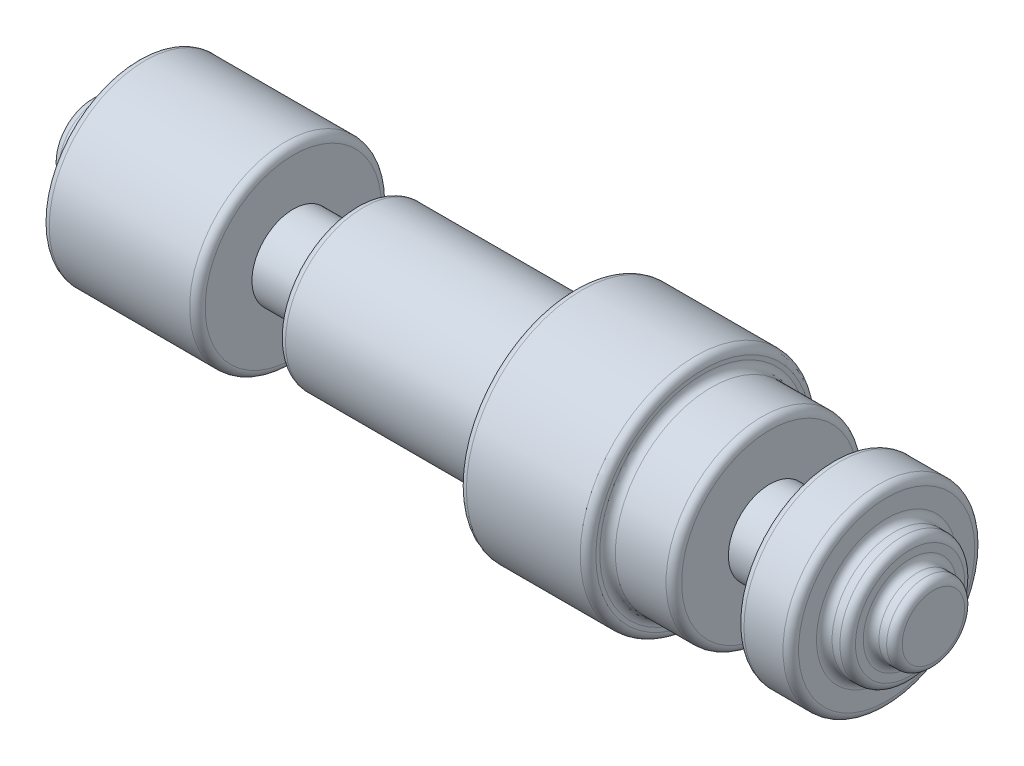
ISO-10303-21;
HEADER;
FILE_DESCRIPTION(('STEP AP214'),'2;1');
FILE_NAME('part.step','',(''),(''),'','','');
FILE_SCHEMA(('AUTOMOTIVE_DESIGN { 1 0 10303 214 1 1 1 1 }'));
ENDSEC;
DATA;
#1=APPLICATION_CONTEXT('core data for automotive mechanical design processes');
#2=APPLICATION_PROTOCOL_DEFINITION('international standard','automotive_design',2000,#1);
#3=PRODUCT_CONTEXT('',#1,'mechanical');
#4=PRODUCT('Part','Part','',(#3));
#5=PRODUCT_RELATED_PRODUCT_CATEGORY('part','',(#4));
#6=PRODUCT_DEFINITION_FORMATION('','',#4);
#7=PRODUCT_DEFINITION_CONTEXT('part definition',#1,'design');
#8=PRODUCT_DEFINITION('design','',#6,#7);
#9=PRODUCT_DEFINITION_SHAPE('','',#8);
#10=(LENGTH_UNIT() NAMED_UNIT(*) SI_UNIT(.MILLI.,.METRE.));
#11=(NAMED_UNIT(*) PLANE_ANGLE_UNIT() SI_UNIT($,.RADIAN.));
#12=(NAMED_UNIT(*) SI_UNIT($,.STERADIAN.) SOLID_ANGLE_UNIT());
#13=UNCERTAINTY_MEASURE_WITH_UNIT(LENGTH_MEASURE(1.E-05),#10,'distance_accuracy_value','');
#14=(GEOMETRIC_REPRESENTATION_CONTEXT(3) GLOBAL_UNCERTAINTY_ASSIGNED_CONTEXT((#13)) GLOBAL_UNIT_ASSIGNED_CONTEXT((#10,
#11,#12)) REPRESENTATION_CONTEXT('',''));
#15=CARTESIAN_POINT('',(0.,0.,0.));
#16=DIRECTION('',(0.,0.,1.));
#17=DIRECTION('',(1.,0.,0.));
#18=AXIS2_PLACEMENT_3D('',#15,#16,#17);
#19=CARTESIAN_POINT('',(0.,0.,0.));
#20=DIRECTION('',(-1.,0.,0.));
#21=DIRECTION('',(0.,0.,1.));
#22=AXIS2_PLACEMENT_3D('',#19,#20,#21);
#23=PLANE('',#22);
#24=CARTESIAN_POINT('',(0.,0.,0.));
#25=DIRECTION('',(-1.,0.,0.));
#26=DIRECTION('',(0.,0.,1.));
#27=AXIS2_PLACEMENT_3D('',#24,#25,#26);
#28=CIRCLE('',#27,1.016);
#29=CARTESIAN_POINT('',(0.,0.,1.016));
#30=VERTEX_POINT('',#29);
#31=EDGE_CURVE('E109',#30,#30,#28,.T.);
#32=ORIENTED_EDGE('',*,*,#31,.T.);
#33=EDGE_LOOP('',(#32));
#34=FACE_BOUND('',#33,.T.);
#35=ADVANCED_FACE('F29',(#34),#23,.T.);
#36=CARTESIAN_POINT('',(0.,0.,0.));
#37=DIRECTION('',(1.,0.,0.));
#38=DIRECTION('',(0.,0.,-1.));
#39=AXIS2_PLACEMENT_3D('',#36,#37,#38);
#40=CYLINDRICAL_SURFACE('',#39,1.27);
#41=CARTESIAN_POINT('',(0.508,0.,0.));
#42=DIRECTION('',(-1.,0.,0.));
#43=DIRECTION('',(0.,0.,1.));
#44=AXIS2_PLACEMENT_3D('',#41,#42,#43);
#45=CIRCLE('',#44,1.27);
#46=CARTESIAN_POINT('',(0.508,0.,1.27));
#47=VERTEX_POINT('',#46);
#48=EDGE_CURVE('E112',#47,#47,#45,.T.);
#49=ORIENTED_EDGE('',*,*,#48,.T.);
#50=EDGE_LOOP('',(#49));
#51=FACE_BOUND('',#50,.T.);
#52=CARTESIAN_POINT('',(0.254,0.,0.));
#53=DIRECTION('',(-1.,0.,0.));
#54=DIRECTION('',(0.,0.,1.));
#55=AXIS2_PLACEMENT_3D('',#52,#53,#54);
#56=CIRCLE('',#55,1.27);
#57=CARTESIAN_POINT('',(0.254,0.,1.27));
#58=VERTEX_POINT('',#57);
#59=EDGE_CURVE('E115',#58,#58,#56,.F.);
#60=ORIENTED_EDGE('',*,*,#59,.T.);
#61=EDGE_LOOP('',(#60));
#62=FACE_BOUND('',#61,.T.);
#63=ADVANCED_FACE('F173',(#51,#62),#40,.T.);
#64=CARTESIAN_POINT('',(0.762,1.27,0.));
#65=DIRECTION('',(-1.,0.,0.));
#66=DIRECTION('',(0.,0.,1.));
#67=AXIS2_PLACEMENT_3D('',#64,#65,#66);
#68=PLANE('',#67);
#69=CARTESIAN_POINT('',(0.762,0.,0.));
#70=DIRECTION('',(-1.,0.,0.));
#71=DIRECTION('',(0.,0.,1.));
#72=AXIS2_PLACEMENT_3D('',#69,#70,#71);
#73=CIRCLE('',#72,1.778);
#74=CARTESIAN_POINT('',(0.762,0.,1.778));
#75=VERTEX_POINT('',#74);
#76=EDGE_CURVE('E118',#75,#75,#73,.T.);
#77=ORIENTED_EDGE('',*,*,#76,.T.);
#78=EDGE_LOOP('',(#77));
#79=FACE_BOUND('',#78,.T.);
#80=CARTESIAN_POINT('',(0.762,0.,0.));
#81=DIRECTION('',(-1.,0.,0.));
#82=DIRECTION('',(0.,0.,1.));
#83=AXIS2_PLACEMENT_3D('',#80,#81,#82);
#84=CIRCLE('',#83,1.524);
#85=CARTESIAN_POINT('',(0.762,0.,1.524));
#86=VERTEX_POINT('',#85);
#87=EDGE_CURVE('E121',#86,#86,#84,.F.);
#88=ORIENTED_EDGE('',*,*,#87,.T.);
#89=EDGE_LOOP('',(#88));
#90=FACE_BOUND('',#89,.T.);
#91=ADVANCED_FACE('F179',(#79,#90),#68,.T.);
#92=CARTESIAN_POINT('',(0.,0.,0.));
#93=DIRECTION('',(1.,0.,0.));
#94=DIRECTION('',(0.,0.,-1.));
#95=AXIS2_PLACEMENT_3D('',#92,#93,#94);
#96=CYLINDRICAL_SURFACE('',#95,2.032);
#97=CARTESIAN_POINT('',(1.27,0.,0.));
#98=DIRECTION('',(-1.,0.,0.));
#99=DIRECTION('',(0.,0.,1.));
#100=AXIS2_PLACEMENT_3D('',#97,#98,#99);
#101=CIRCLE('',#100,2.032);
#102=CARTESIAN_POINT('',(1.27,0.,2.032));
#103=VERTEX_POINT('',#102);
#104=EDGE_CURVE('E124',#103,#103,#101,.T.);
#105=ORIENTED_EDGE('',*,*,#104,.T.);
#106=EDGE_LOOP('',(#105));
#107=FACE_BOUND('',#106,.T.);
#108=CARTESIAN_POINT('',(1.016,0.,0.));
#109=DIRECTION('',(-1.,0.,0.));
#110=DIRECTION('',(0.,0.,1.));
#111=AXIS2_PLACEMENT_3D('',#108,#109,#110);
#112=CIRCLE('',#111,2.032);
#113=CARTESIAN_POINT('',(1.016,0.,2.032));
#114=VERTEX_POINT('',#113);
#115=EDGE_CURVE('E127',#114,#114,#112,.F.);
#116=ORIENTED_EDGE('',*,*,#115,.T.);
#117=EDGE_LOOP('',(#116));
#118=FACE_BOUND('',#117,.T.);
#119=ADVANCED_FACE('F291',(#107,#118),#96,.T.);
#120=CARTESIAN_POINT('',(1.524,2.032,0.));
#121=DIRECTION('',(-1.,0.,0.));
#122=DIRECTION('',(0.,0.,1.));
#123=AXIS2_PLACEMENT_3D('',#120,#121,#122);
#124=PLANE('',#123);
#125=CARTESIAN_POINT('',(1.524,0.,0.));
#126=DIRECTION('',(-1.,0.,0.));
#127=DIRECTION('',(0.,0.,1.));
#128=AXIS2_PLACEMENT_3D('',#125,#126,#127);
#129=CIRCLE('',#128,2.8702);
#130=CARTESIAN_POINT('',(1.524,0.,2.8702));
#131=VERTEX_POINT('',#130);
#132=EDGE_CURVE('E130',#131,#131,#129,.T.);
#133=ORIENTED_EDGE('',*,*,#132,.T.);
#134=EDGE_LOOP('',(#133));
#135=FACE_BOUND('',#134,.T.);
#136=CARTESIAN_POINT('',(1.524,0.,0.));
#137=DIRECTION('',(-1.,0.,0.));
#138=DIRECTION('',(0.,0.,1.));
#139=AXIS2_PLACEMENT_3D('',#136,#137,#138);
#140=CIRCLE('',#139,2.286);
#141=CARTESIAN_POINT('',(1.524,0.,2.286));
#142=VERTEX_POINT('',#141);
#143=EDGE_CURVE('E133',#142,#142,#140,.F.);
#144=ORIENTED_EDGE('',*,*,#143,.T.);
#145=EDGE_LOOP('',(#144));
#146=FACE_BOUND('',#145,.T.);
#147=ADVANCED_FACE('F288',(#135,#146),#124,.T.);
#148=CARTESIAN_POINT('',(0.,0.,0.));
#149=DIRECTION('',(1.,0.,0.));
#150=DIRECTION('',(0.,0.,-1.));
#151=AXIS2_PLACEMENT_3D('',#148,#149,#150);
#152=CYLINDRICAL_SURFACE('',#151,3.1242);
#153=CARTESIAN_POINT('',(6.35,0.,0.));
#154=DIRECTION('',(1.,0.,0.));
#155=DIRECTION('',(0.,0.,-1.));
#156=AXIS2_PLACEMENT_3D('',#153,#154,#155);
#157=CIRCLE('',#156,3.1242);
#158=CARTESIAN_POINT('',(6.35,0.,-3.1242));
#159=VERTEX_POINT('',#158);
#160=EDGE_CURVE('E10',#159,#159,#157,.F.);
#161=ORIENTED_EDGE('',*,*,#160,.T.);
#162=EDGE_LOOP('',(#161));
#163=FACE_BOUND('',#162,.T.);
#164=CARTESIAN_POINT('',(1.778,0.,0.));
#165=DIRECTION('',(-1.,0.,0.));
#166=DIRECTION('',(0.,0.,1.));
#167=AXIS2_PLACEMENT_3D('',#164,#165,#166);
#168=CIRCLE('',#167,3.1242);
#169=CARTESIAN_POINT('',(1.778,0.,3.1242));
#170=VERTEX_POINT('',#169);
#171=EDGE_CURVE('E136',#170,#170,#168,.F.);
#172=ORIENTED_EDGE('',*,*,#171,.T.);
#173=EDGE_LOOP('',(#172));
#174=FACE_BOUND('',#173,.T.);
#175=ADVANCED_FACE('F285',(#163,#174),#152,.T.);
#176=CARTESIAN_POINT('',(6.604,3.1242,0.));
#177=DIRECTION('',(1.,0.,0.));
#178=DIRECTION('',(0.,0.,-1.));
#179=AXIS2_PLACEMENT_3D('',#176,#177,#178);
#180=PLANE('',#179);
#181=CARTESIAN_POINT('',(6.604,0.,0.));
#182=DIRECTION('',(1.,0.,0.));
#183=DIRECTION('',(0.,0.,-1.));
#184=AXIS2_PLACEMENT_3D('',#181,#182,#183);
#185=CIRCLE('',#184,2.8702);
#186=CARTESIAN_POINT('',(6.604,0.,-2.8702));
#187=VERTEX_POINT('',#186);
#188=EDGE_CURVE('E36',#187,#187,#185,.T.);
#189=ORIENTED_EDGE('',*,*,#188,.T.);
#190=EDGE_LOOP('',(#189));
#191=FACE_BOUND('',#190,.T.);
#192=CARTESIAN_POINT('',(6.604,0.,0.));
#193=DIRECTION('',(1.,0.,0.));
#194=DIRECTION('',(0.,0.,-1.));
#195=AXIS2_PLACEMENT_3D('',#192,#193,#194);
#196=CIRCLE('',#195,1.3462);
#197=CARTESIAN_POINT('',(6.604,0.,-1.3462));
#198=VERTEX_POINT('',#197);
#199=EDGE_CURVE('E139',#198,#198,#196,.T.);
#200=ORIENTED_EDGE('',*,*,#199,.F.);
#201=EDGE_LOOP('',(#200));
#202=FACE_BOUND('',#201,.T.);
#203=ADVANCED_FACE('F281',(#191,#202),#180,.T.);
#204=CARTESIAN_POINT('',(0.,0.,0.));
#205=DIRECTION('',(1.,0.,0.));
#206=DIRECTION('',(0.,0.,-1.));
#207=AXIS2_PLACEMENT_3D('',#204,#205,#206);
#208=CYLINDRICAL_SURFACE('',#207,1.3462);
#209=ORIENTED_EDGE('',*,*,#199,.T.);
#210=EDGE_LOOP('',(#209));
#211=FACE_BOUND('',#210,.T.);
#212=CARTESIAN_POINT('',(8.636,0.,0.));
#213=DIRECTION('',(1.,0.,0.));
#214=DIRECTION('',(0.,0.,-1.));
#215=AXIS2_PLACEMENT_3D('',#212,#213,#214);
#216=CIRCLE('',#215,1.3462);
#217=CARTESIAN_POINT('',(8.636,0.,-1.3462));
#218=VERTEX_POINT('',#217);
#219=EDGE_CURVE('E142',#218,#218,#216,.T.);
#220=ORIENTED_EDGE('',*,*,#219,.F.);
#221=EDGE_LOOP('',(#220));
#222=FACE_BOUND('',#221,.T.);
#223=ADVANCED_FACE('F277',(#211,#222),#208,.T.);
#224=CARTESIAN_POINT('',(8.636,1.3462,0.));
#225=DIRECTION('',(-1.,0.,0.));
#226=DIRECTION('',(0.,0.,1.));
#227=AXIS2_PLACEMENT_3D('',#224,#225,#226);
#228=PLANE('',#227);
#229=CARTESIAN_POINT('',(8.636,0.,0.));
#230=DIRECTION('',(-1.,0.,0.));
#231=DIRECTION('',(0.,0.,1.));
#232=AXIS2_PLACEMENT_3D('',#229,#230,#231);
#233=CIRCLE('',#232,2.286);
#234=CARTESIAN_POINT('',(8.636,0.,2.286));
#235=VERTEX_POINT('',#234);
#236=EDGE_CURVE('E40',#235,#235,#233,.T.);
#237=ORIENTED_EDGE('',*,*,#236,.T.);
#238=EDGE_LOOP('',(#237));
#239=FACE_BOUND('',#238,.T.);
#240=ORIENTED_EDGE('',*,*,#219,.T.);
#241=EDGE_LOOP('',(#240));
#242=FACE_BOUND('',#241,.T.);
#243=ADVANCED_FACE('F259',(#239,#242),#228,.T.);
#244=CARTESIAN_POINT('',(0.,0.,0.));
#245=DIRECTION('',(1.,0.,0.));
#246=DIRECTION('',(0.,0.,-1.));
#247=AXIS2_PLACEMENT_3D('',#244,#245,#246);
#248=CYLINDRICAL_SURFACE('',#247,2.54);
#249=CARTESIAN_POINT('',(8.89,0.,0.));
#250=DIRECTION('',(-1.,0.,0.));
#251=DIRECTION('',(0.,0.,1.));
#252=AXIS2_PLACEMENT_3D('',#249,#250,#251);
#253=CIRCLE('',#252,2.54);
#254=CARTESIAN_POINT('',(8.89,0.,2.54));
#255=VERTEX_POINT('',#254);
#256=EDGE_CURVE('E44',#255,#255,#253,.F.);
#257=ORIENTED_EDGE('',*,*,#256,.T.);
#258=EDGE_LOOP('',(#257));
#259=FACE_BOUND('',#258,.T.);
#260=CARTESIAN_POINT('',(15.748,0.,0.));
#261=DIRECTION('',(1.,0.,0.));
#262=DIRECTION('',(0.,0.,-1.));
#263=AXIS2_PLACEMENT_3D('',#260,#261,#262);
#264=CIRCLE('',#263,2.54);
#265=CARTESIAN_POINT('',(15.748,0.,-2.54));
#266=VERTEX_POINT('',#265);
#267=EDGE_CURVE('E145',#266,#266,#264,.T.);
#268=ORIENTED_EDGE('',*,*,#267,.F.);
#269=EDGE_LOOP('',(#268));
#270=FACE_BOUND('',#269,.T.);
#271=ADVANCED_FACE('F255',(#259,#270),#248,.T.);
#272=CARTESIAN_POINT('',(15.748,2.54,0.));
#273=DIRECTION('',(-1.,0.,0.));
#274=DIRECTION('',(0.,0.,1.));
#275=AXIS2_PLACEMENT_3D('',#272,#273,#274);
#276=PLANE('',#275);
#277=CARTESIAN_POINT('',(15.748,0.,0.));
#278=DIRECTION('',(-1.,0.,0.));
#279=DIRECTION('',(0.,0.,1.));
#280=AXIS2_PLACEMENT_3D('',#277,#278,#279);
#281=CIRCLE('',#280,3.5052);
#282=CARTESIAN_POINT('',(15.748,0.,3.5052));
#283=VERTEX_POINT('',#282);
#284=EDGE_CURVE('E49',#283,#283,#281,.T.);
#285=ORIENTED_EDGE('',*,*,#284,.T.);
#286=EDGE_LOOP('',(#285));
#287=FACE_BOUND('',#286,.T.);
#288=ORIENTED_EDGE('',*,*,#267,.T.);
#289=EDGE_LOOP('',(#288));
#290=FACE_BOUND('',#289,.T.);
#291=ADVANCED_FACE('F258',(#287,#290),#276,.T.);
#292=CARTESIAN_POINT('',(0.,0.,0.));
#293=DIRECTION('',(1.,0.,0.));
#294=DIRECTION('',(0.,0.,-1.));
#295=AXIS2_PLACEMENT_3D('',#292,#293,#294);
#296=CYLINDRICAL_SURFACE('',#295,3.7592);
#297=CARTESIAN_POINT('',(19.7104,0.,0.));
#298=DIRECTION('',(1.,0.,0.));
#299=DIRECTION('',(0.,0.,-1.));
#300=AXIS2_PLACEMENT_3D('',#297,#298,#299);
#301=CIRCLE('',#300,3.7592);
#302=CARTESIAN_POINT('',(19.7104,0.,-3.7592));
#303=VERTEX_POINT('',#302);
#304=EDGE_CURVE('E52',#303,#303,#301,.F.);
#305=ORIENTED_EDGE('',*,*,#304,.T.);
#306=EDGE_LOOP('',(#305));
#307=FACE_BOUND('',#306,.T.);
#308=CARTESIAN_POINT('',(16.002,0.,0.));
#309=DIRECTION('',(-1.,0.,0.));
#310=DIRECTION('',(0.,0.,1.));
#311=AXIS2_PLACEMENT_3D('',#308,#309,#310);
#312=CIRCLE('',#311,3.7592);
#313=CARTESIAN_POINT('',(16.002,0.,3.7592));
#314=VERTEX_POINT('',#313);
#315=EDGE_CURVE('E55',#314,#314,#312,.F.);
#316=ORIENTED_EDGE('',*,*,#315,.T.);
#317=EDGE_LOOP('',(#316));
#318=FACE_BOUND('',#317,.T.);
#319=ADVANCED_FACE('F264',(#307,#318),#296,.T.);
#320=CARTESIAN_POINT('',(19.9644,3.7592,0.));
#321=DIRECTION('',(1.,0.,0.));
#322=DIRECTION('',(0.,0.,-1.));
#323=AXIS2_PLACEMENT_3D('',#320,#321,#322);
#324=PLANE('',#323);
#325=CARTESIAN_POINT('',(19.9644,0.,0.));
#326=DIRECTION('',(1.,0.,0.));
#327=DIRECTION('',(0.,0.,-1.));
#328=AXIS2_PLACEMENT_3D('',#325,#326,#327);
#329=CIRCLE('',#328,3.3782);
#330=CARTESIAN_POINT('',(19.9644,0.,-3.3782));
#331=VERTEX_POINT('',#330);
#332=EDGE_CURVE('E58',#331,#331,#329,.F.);
#333=ORIENTED_EDGE('',*,*,#332,.T.);
#334=EDGE_LOOP('',(#333));
#335=FACE_BOUND('',#334,.T.);
#336=CARTESIAN_POINT('',(19.9644,0.,0.));
#337=DIRECTION('',(1.,0.,0.));
#338=DIRECTION('',(0.,0.,-1.));
#339=AXIS2_PLACEMENT_3D('',#336,#337,#338);
#340=CIRCLE('',#339,3.5052);
#341=CARTESIAN_POINT('',(19.9644,0.,-3.5052));
#342=VERTEX_POINT('',#341);
#343=EDGE_CURVE('E61',#342,#342,#340,.T.);
#344=ORIENTED_EDGE('',*,*,#343,.T.);
#345=EDGE_LOOP('',(#344));
#346=FACE_BOUND('',#345,.T.);
#347=ADVANCED_FACE('F270',(#335,#346),#324,.T.);
#348=CARTESIAN_POINT('',(0.,0.,0.));
#349=DIRECTION('',(1.,0.,0.));
#350=DIRECTION('',(0.,0.,-1.));
#351=AXIS2_PLACEMENT_3D('',#348,#349,#350);
#352=CYLINDRICAL_SURFACE('',#351,3.1242);
#353=CARTESIAN_POINT('',(21.8694,0.,0.));
#354=DIRECTION('',(1.,0.,0.));
#355=DIRECTION('',(0.,0.,-1.));
#356=AXIS2_PLACEMENT_3D('',#353,#354,#355);
#357=CIRCLE('',#356,3.1242);
#358=CARTESIAN_POINT('',(21.8694,0.,-3.1242));
#359=VERTEX_POINT('',#358);
#360=EDGE_CURVE('E64',#359,#359,#357,.F.);
#361=ORIENTED_EDGE('',*,*,#360,.T.);
#362=EDGE_LOOP('',(#361));
#363=FACE_BOUND('',#362,.T.);
#364=CARTESIAN_POINT('',(20.2184,0.,0.));
#365=DIRECTION('',(1.,0.,0.));
#366=DIRECTION('',(0.,0.,-1.));
#367=AXIS2_PLACEMENT_3D('',#364,#365,#366);
#368=CIRCLE('',#367,3.1242);
#369=CARTESIAN_POINT('',(20.2184,0.,-3.1242));
#370=VERTEX_POINT('',#369);
#371=EDGE_CURVE('E67',#370,#370,#368,.T.);
#372=ORIENTED_EDGE('',*,*,#371,.T.);
#373=EDGE_LOOP('',(#372));
#374=FACE_BOUND('',#373,.T.);
#375=ADVANCED_FACE('F169',(#363,#374),#352,.T.);
#376=CARTESIAN_POINT('',(22.1234,3.1242,0.));
#377=DIRECTION('',(1.,0.,0.));
#378=DIRECTION('',(0.,0.,-1.));
#379=AXIS2_PLACEMENT_3D('',#376,#377,#378);
#380=PLANE('',#379);
#381=CARTESIAN_POINT('',(22.1234,0.,0.));
#382=DIRECTION('',(1.,0.,0.));
#383=DIRECTION('',(0.,0.,-1.));
#384=AXIS2_PLACEMENT_3D('',#381,#382,#383);
#385=CIRCLE('',#384,2.8702);
#386=CARTESIAN_POINT('',(22.1234,0.,-2.8702));
#387=VERTEX_POINT('',#386);
#388=EDGE_CURVE('E70',#387,#387,#385,.T.);
#389=ORIENTED_EDGE('',*,*,#388,.T.);
#390=EDGE_LOOP('',(#389));
#391=FACE_BOUND('',#390,.T.);
#392=CARTESIAN_POINT('',(22.1234,0.,0.));
#393=DIRECTION('',(1.,0.,0.));
#394=DIRECTION('',(0.,0.,-1.));
#395=AXIS2_PLACEMENT_3D('',#392,#393,#394);
#396=CIRCLE('',#395,1.3462);
#397=CARTESIAN_POINT('',(22.1234,0.,-1.3462));
#398=VERTEX_POINT('',#397);
#399=EDGE_CURVE('E148',#398,#398,#396,.T.);
#400=ORIENTED_EDGE('',*,*,#399,.F.);
#401=EDGE_LOOP('',(#400));
#402=FACE_BOUND('',#401,.T.);
#403=ADVANCED_FACE('F159',(#391,#402),#380,.T.);
#404=CARTESIAN_POINT('',(0.,0.,0.));
#405=DIRECTION('',(1.,0.,0.));
#406=DIRECTION('',(0.,0.,-1.));
#407=AXIS2_PLACEMENT_3D('',#404,#405,#406);
#408=CYLINDRICAL_SURFACE('',#407,1.3462);
#409=ORIENTED_EDGE('',*,*,#399,.T.);
#410=EDGE_LOOP('',(#409));
#411=FACE_BOUND('',#410,.T.);
#412=CARTESIAN_POINT('',(24.1554,0.,0.));
#413=DIRECTION('',(1.,0.,0.));
#414=DIRECTION('',(0.,0.,-1.));
#415=AXIS2_PLACEMENT_3D('',#412,#413,#414);
#416=CIRCLE('',#415,1.3462);
#417=CARTESIAN_POINT('',(24.1554,0.,-1.3462));
#418=VERTEX_POINT('',#417);
#419=EDGE_CURVE('E151',#418,#418,#416,.T.);
#420=ORIENTED_EDGE('',*,*,#419,.F.);
#421=EDGE_LOOP('',(#420));
#422=FACE_BOUND('',#421,.T.);
#423=ADVANCED_FACE('F157',(#411,#422),#408,.T.);
#424=CARTESIAN_POINT('',(24.1554,1.3462,0.));
#425=DIRECTION('',(-1.,0.,0.));
#426=DIRECTION('',(0.,0.,1.));
#427=AXIS2_PLACEMENT_3D('',#424,#425,#426);
#428=PLANE('',#427);
#429=CARTESIAN_POINT('',(24.1554,0.,0.));
#430=DIRECTION('',(-1.,0.,0.));
#431=DIRECTION('',(0.,0.,1.));
#432=AXIS2_PLACEMENT_3D('',#429,#430,#431);
#433=CIRCLE('',#432,2.8702);
#434=CARTESIAN_POINT('',(24.1554,0.,2.8702));
#435=VERTEX_POINT('',#434);
#436=EDGE_CURVE('E73',#435,#435,#433,.T.);
#437=ORIENTED_EDGE('',*,*,#436,.T.);
#438=EDGE_LOOP('',(#437));
#439=FACE_BOUND('',#438,.T.);
#440=ORIENTED_EDGE('',*,*,#419,.T.);
#441=EDGE_LOOP('',(#440));
#442=FACE_BOUND('',#441,.T.);
#443=ADVANCED_FACE('F155',(#439,#442),#428,.T.);
#444=CARTESIAN_POINT('',(0.,0.,0.));
#445=DIRECTION('',(1.,0.,0.));
#446=DIRECTION('',(0.,0.,-1.));
#447=AXIS2_PLACEMENT_3D('',#444,#445,#446);
#448=CYLINDRICAL_SURFACE('',#447,3.1242);
#449=CARTESIAN_POINT('',(25.6794,0.,0.));
#450=DIRECTION('',(1.,0.,0.));
#451=DIRECTION('',(0.,0.,-1.));
#452=AXIS2_PLACEMENT_3D('',#449,#450,#451);
#453=CIRCLE('',#452,3.1242);
#454=CARTESIAN_POINT('',(25.6794,0.,-3.1242));
#455=VERTEX_POINT('',#454);
#456=EDGE_CURVE('E76',#455,#455,#453,.F.);
#457=ORIENTED_EDGE('',*,*,#456,.T.);
#458=EDGE_LOOP('',(#457));
#459=FACE_BOUND('',#458,.T.);
#460=CARTESIAN_POINT('',(24.4094,0.,0.));
#461=DIRECTION('',(-1.,0.,0.));
#462=DIRECTION('',(0.,0.,1.));
#463=AXIS2_PLACEMENT_3D('',#460,#461,#462);
#464=CIRCLE('',#463,3.1242);
#465=CARTESIAN_POINT('',(24.4094,0.,3.1242));
#466=VERTEX_POINT('',#465);
#467=EDGE_CURVE('E79',#466,#466,#464,.F.);
#468=ORIENTED_EDGE('',*,*,#467,.T.);
#469=EDGE_LOOP('',(#468));
#470=FACE_BOUND('',#469,.T.);
#471=ADVANCED_FACE('F166',(#459,#470),#448,.T.);
#472=CARTESIAN_POINT('',(25.9334,3.1242,0.));
#473=DIRECTION('',(1.,0.,0.));
#474=DIRECTION('',(0.,0.,-1.));
#475=AXIS2_PLACEMENT_3D('',#472,#473,#474);
#476=PLANE('',#475);
#477=CARTESIAN_POINT('',(25.9334,0.,0.));
#478=DIRECTION('',(1.,0.,0.));
#479=DIRECTION('',(0.,0.,-1.));
#480=AXIS2_PLACEMENT_3D('',#477,#478,#479);
#481=CIRCLE('',#480,2.286);
#482=CARTESIAN_POINT('',(25.9334,0.,-2.286));
#483=VERTEX_POINT('',#482);
#484=EDGE_CURVE('E82',#483,#483,#481,.F.);
#485=ORIENTED_EDGE('',*,*,#484,.T.);
#486=EDGE_LOOP('',(#485));
#487=FACE_BOUND('',#486,.T.);
#488=CARTESIAN_POINT('',(25.9334,0.,0.));
#489=DIRECTION('',(1.,0.,0.));
#490=DIRECTION('',(0.,0.,-1.));
#491=AXIS2_PLACEMENT_3D('',#488,#489,#490);
#492=CIRCLE('',#491,2.8702);
#493=CARTESIAN_POINT('',(25.9334,0.,-2.8702));
#494=VERTEX_POINT('',#493);
#495=EDGE_CURVE('E85',#494,#494,#492,.T.);
#496=ORIENTED_EDGE('',*,*,#495,.T.);
#497=EDGE_LOOP('',(#496));
#498=FACE_BOUND('',#497,.T.);
#499=ADVANCED_FACE('F387',(#487,#498),#476,.T.);
#500=CARTESIAN_POINT('',(0.,0.,0.));
#501=DIRECTION('',(1.,0.,0.));
#502=DIRECTION('',(0.,0.,-1.));
#503=AXIS2_PLACEMENT_3D('',#500,#501,#502);
#504=CYLINDRICAL_SURFACE('',#503,2.032);
#505=CARTESIAN_POINT('',(26.4414,0.,0.));
#506=DIRECTION('',(1.,0.,0.));
#507=DIRECTION('',(0.,0.,-1.));
#508=AXIS2_PLACEMENT_3D('',#505,#506,#507);
#509=CIRCLE('',#508,2.032);
#510=CARTESIAN_POINT('',(26.4414,0.,-2.032));
#511=VERTEX_POINT('',#510);
#512=EDGE_CURVE('E88',#511,#511,#509,.F.);
#513=ORIENTED_EDGE('',*,*,#512,.T.);
#514=EDGE_LOOP('',(#513));
#515=FACE_BOUND('',#514,.T.);
#516=CARTESIAN_POINT('',(26.1874,0.,0.));
#517=DIRECTION('',(1.,0.,0.));
#518=DIRECTION('',(0.,0.,-1.));
#519=AXIS2_PLACEMENT_3D('',#516,#517,#518);
#520=CIRCLE('',#519,2.032);
#521=CARTESIAN_POINT('',(26.1874,0.,-2.032));
#522=VERTEX_POINT('',#521);
#523=EDGE_CURVE('E91',#522,#522,#520,.T.);
#524=ORIENTED_EDGE('',*,*,#523,.T.);
#525=EDGE_LOOP('',(#524));
#526=FACE_BOUND('',#525,.T.);
#527=ADVANCED_FACE('F397',(#515,#526),#504,.T.);
#528=CARTESIAN_POINT('',(26.6954,2.032,0.));
#529=DIRECTION('',(1.,0.,0.));
#530=DIRECTION('',(0.,0.,-1.));
#531=AXIS2_PLACEMENT_3D('',#528,#529,#530);
#532=PLANE('',#531);
#533=CARTESIAN_POINT('',(26.6954,0.,0.));
#534=DIRECTION('',(1.,0.,0.));
#535=DIRECTION('',(0.,0.,-1.));
#536=AXIS2_PLACEMENT_3D('',#533,#534,#535);
#537=CIRCLE('',#536,1.524);
#538=CARTESIAN_POINT('',(26.6954,0.,-1.524));
#539=VERTEX_POINT('',#538);
#540=EDGE_CURVE('E94',#539,#539,#537,.F.);
#541=ORIENTED_EDGE('',*,*,#540,.T.);
#542=EDGE_LOOP('',(#541));
#543=FACE_BOUND('',#542,.T.);
#544=CARTESIAN_POINT('',(26.6954,0.,0.));
#545=DIRECTION('',(1.,0.,0.));
#546=DIRECTION('',(0.,0.,-1.));
#547=AXIS2_PLACEMENT_3D('',#544,#545,#546);
#548=CIRCLE('',#547,1.778);
#549=CARTESIAN_POINT('',(26.6954,0.,-1.778));
#550=VERTEX_POINT('',#549);
#551=EDGE_CURVE('E97',#550,#550,#548,.T.);
#552=ORIENTED_EDGE('',*,*,#551,.T.);
#553=EDGE_LOOP('',(#552));
#554=FACE_BOUND('',#553,.T.);
#555=ADVANCED_FACE('F407',(#543,#554),#532,.T.);
#556=CARTESIAN_POINT('',(0.,0.,0.));
#557=DIRECTION('',(1.,0.,0.));
#558=DIRECTION('',(0.,0.,-1.));
#559=AXIS2_PLACEMENT_3D('',#556,#557,#558);
#560=CYLINDRICAL_SURFACE('',#559,1.27);
#561=CARTESIAN_POINT('',(27.2034,0.,0.));
#562=DIRECTION('',(1.,0.,0.));
#563=DIRECTION('',(0.,0.,-1.));
#564=AXIS2_PLACEMENT_3D('',#561,#562,#563);
#565=CIRCLE('',#564,1.27);
#566=CARTESIAN_POINT('',(27.2034,0.,-1.27));
#567=VERTEX_POINT('',#566);
#568=EDGE_CURVE('E100',#567,#567,#565,.F.);
#569=ORIENTED_EDGE('',*,*,#568,.T.);
#570=EDGE_LOOP('',(#569));
#571=FACE_BOUND('',#570,.T.);
#572=CARTESIAN_POINT('',(26.9494,0.,0.));
#573=DIRECTION('',(1.,0.,0.));
#574=DIRECTION('',(0.,0.,-1.));
#575=AXIS2_PLACEMENT_3D('',#572,#573,#574);
#576=CIRCLE('',#575,1.27);
#577=CARTESIAN_POINT('',(26.9494,0.,-1.27));
#578=VERTEX_POINT('',#577);
#579=EDGE_CURVE('E103',#578,#578,#576,.T.);
#580=ORIENTED_EDGE('',*,*,#579,.T.);
#581=EDGE_LOOP('',(#580));
#582=FACE_BOUND('',#581,.T.);
#583=ADVANCED_FACE('F417',(#571,#582),#560,.T.);
#584=CARTESIAN_POINT('',(27.4574,1.27,0.));
#585=DIRECTION('',(1.,0.,0.));
#586=DIRECTION('',(0.,0.,-1.));
#587=AXIS2_PLACEMENT_3D('',#584,#585,#586);
#588=PLANE('',#587);
#589=CARTESIAN_POINT('',(27.4574,0.,0.));
#590=DIRECTION('',(1.,0.,0.));
#591=DIRECTION('',(0.,0.,-1.));
#592=AXIS2_PLACEMENT_3D('',#589,#590,#591);
#593=CIRCLE('',#592,1.016);
#594=CARTESIAN_POINT('',(27.4574,0.,-1.016));
#595=VERTEX_POINT('',#594);
#596=EDGE_CURVE('E106',#595,#595,#593,.T.);
#597=ORIENTED_EDGE('',*,*,#596,.T.);
#598=EDGE_LOOP('',(#597));
#599=FACE_BOUND('',#598,.T.);
#600=ADVANCED_FACE('F188',(#599),#588,.T.);
#601=CARTESIAN_POINT('',(1.778,0.,0.));
#602=DIRECTION('',(-1.,0.,0.));
#603=DIRECTION('',(0.,0.,1.));
#604=AXIS2_PLACEMENT_3D('',#601,#602,#603);
#605=TOROIDAL_SURFACE('',#604,2.8702,0.254);
#606=ORIENTED_EDGE('',*,*,#132,.F.);
#607=EDGE_LOOP('',(#606));
#608=FACE_BOUND('',#607,.T.);
#609=ORIENTED_EDGE('',*,*,#171,.F.);
#610=EDGE_LOOP('',(#609));
#611=FACE_BOUND('',#610,.T.);
#612=ADVANCED_FACE('F184',(#608,#611),#605,.T.);
#613=CARTESIAN_POINT('',(1.27,0.,0.));
#614=DIRECTION('',(-1.,0.,0.));
#615=DIRECTION('',(0.,0.,1.));
#616=AXIS2_PLACEMENT_3D('',#613,#614,#615);
#617=TOROIDAL_SURFACE('',#616,2.286,0.254);
#618=ORIENTED_EDGE('',*,*,#104,.F.);
#619=EDGE_LOOP('',(#618));
#620=FACE_BOUND('',#619,.T.);
#621=ORIENTED_EDGE('',*,*,#143,.F.);
#622=EDGE_LOOP('',(#621));
#623=FACE_BOUND('',#622,.T.);
#624=ADVANCED_FACE('F187',(#620,#623),#617,.F.);
#625=CARTESIAN_POINT('',(1.016,0.,0.));
#626=DIRECTION('',(-1.,0.,0.));
#627=DIRECTION('',(0.,0.,1.));
#628=AXIS2_PLACEMENT_3D('',#625,#626,#627);
#629=TOROIDAL_SURFACE('',#628,1.778,0.254);
#630=ORIENTED_EDGE('',*,*,#76,.F.);
#631=EDGE_LOOP('',(#630));
#632=FACE_BOUND('',#631,.T.);
#633=ORIENTED_EDGE('',*,*,#115,.F.);
#634=EDGE_LOOP('',(#633));
#635=FACE_BOUND('',#634,.T.);
#636=ADVANCED_FACE('F192',(#632,#635),#629,.T.);
#637=CARTESIAN_POINT('',(0.508,0.,0.));
#638=DIRECTION('',(-1.,0.,0.));
#639=DIRECTION('',(0.,0.,1.));
#640=AXIS2_PLACEMENT_3D('',#637,#638,#639);
#641=TOROIDAL_SURFACE('',#640,1.524,0.254);
#642=ORIENTED_EDGE('',*,*,#48,.F.);
#643=EDGE_LOOP('',(#642));
#644=FACE_BOUND('',#643,.T.);
#645=ORIENTED_EDGE('',*,*,#87,.F.);
#646=EDGE_LOOP('',(#645));
#647=FACE_BOUND('',#646,.T.);
#648=ADVANCED_FACE('F196',(#644,#647),#641,.F.);
#649=CARTESIAN_POINT('',(0.254,0.,0.));
#650=DIRECTION('',(-1.,0.,0.));
#651=DIRECTION('',(0.,0.,1.));
#652=AXIS2_PLACEMENT_3D('',#649,#650,#651);
#653=TOROIDAL_SURFACE('',#652,1.016,0.254);
#654=ORIENTED_EDGE('',*,*,#31,.F.);
#655=EDGE_LOOP('',(#654));
#656=FACE_BOUND('',#655,.T.);
#657=ORIENTED_EDGE('',*,*,#59,.F.);
#658=EDGE_LOOP('',(#657));
#659=FACE_BOUND('',#658,.T.);
#660=ADVANCED_FACE('F200',(#656,#659),#653,.T.);
#661=CARTESIAN_POINT('',(27.2034,0.,0.));
#662=DIRECTION('',(1.,0.,0.));
#663=DIRECTION('',(0.,0.,-1.));
#664=AXIS2_PLACEMENT_3D('',#661,#662,#663);
#665=TOROIDAL_SURFACE('',#664,1.016,0.254);
#666=ORIENTED_EDGE('',*,*,#568,.F.);
#667=EDGE_LOOP('',(#666));
#668=FACE_BOUND('',#667,.T.);
#669=ORIENTED_EDGE('',*,*,#596,.F.);
#670=EDGE_LOOP('',(#669));
#671=FACE_BOUND('',#670,.T.);
#672=ADVANCED_FACE('F204',(#668,#671),#665,.T.);
#673=CARTESIAN_POINT('',(26.9494,0.,0.));
#674=DIRECTION('',(1.,0.,0.));
#675=DIRECTION('',(0.,0.,-1.));
#676=AXIS2_PLACEMENT_3D('',#673,#674,#675);
#677=TOROIDAL_SURFACE('',#676,1.524,0.254);
#678=ORIENTED_EDGE('',*,*,#540,.F.);
#679=EDGE_LOOP('',(#678));
#680=FACE_BOUND('',#679,.T.);
#681=ORIENTED_EDGE('',*,*,#579,.F.);
#682=EDGE_LOOP('',(#681));
#683=FACE_BOUND('',#682,.T.);
#684=ADVANCED_FACE('F208',(#680,#683),#677,.F.);
#685=CARTESIAN_POINT('',(26.4414,0.,0.));
#686=DIRECTION('',(1.,0.,0.));
#687=DIRECTION('',(0.,0.,-1.));
#688=AXIS2_PLACEMENT_3D('',#685,#686,#687);
#689=TOROIDAL_SURFACE('',#688,1.778,0.254);
#690=ORIENTED_EDGE('',*,*,#512,.F.);
#691=EDGE_LOOP('',(#690));
#692=FACE_BOUND('',#691,.T.);
#693=ORIENTED_EDGE('',*,*,#551,.F.);
#694=EDGE_LOOP('',(#693));
#695=FACE_BOUND('',#694,.T.);
#696=ADVANCED_FACE('F212',(#692,#695),#689,.T.);
#697=CARTESIAN_POINT('',(26.1874,0.,0.));
#698=DIRECTION('',(1.,0.,0.));
#699=DIRECTION('',(0.,0.,-1.));
#700=AXIS2_PLACEMENT_3D('',#697,#698,#699);
#701=TOROIDAL_SURFACE('',#700,2.286,0.254);
#702=ORIENTED_EDGE('',*,*,#484,.F.);
#703=EDGE_LOOP('',(#702));
#704=FACE_BOUND('',#703,.T.);
#705=ORIENTED_EDGE('',*,*,#523,.F.);
#706=EDGE_LOOP('',(#705));
#707=FACE_BOUND('',#706,.T.);
#708=ADVANCED_FACE('F216',(#704,#707),#701,.F.);
#709=CARTESIAN_POINT('',(25.6794,0.,0.));
#710=DIRECTION('',(1.,0.,0.));
#711=DIRECTION('',(0.,0.,-1.));
#712=AXIS2_PLACEMENT_3D('',#709,#710,#711);
#713=TOROIDAL_SURFACE('',#712,2.8702,0.254);
#714=ORIENTED_EDGE('',*,*,#456,.F.);
#715=EDGE_LOOP('',(#714));
#716=FACE_BOUND('',#715,.T.);
#717=ORIENTED_EDGE('',*,*,#495,.F.);
#718=EDGE_LOOP('',(#717));
#719=FACE_BOUND('',#718,.T.);
#720=ADVANCED_FACE('F220',(#716,#719),#713,.T.);
#721=CARTESIAN_POINT('',(24.4094,0.,0.));
#722=DIRECTION('',(-1.,0.,0.));
#723=DIRECTION('',(0.,0.,1.));
#724=AXIS2_PLACEMENT_3D('',#721,#722,#723);
#725=TOROIDAL_SURFACE('',#724,2.8702,0.254);
#726=ORIENTED_EDGE('',*,*,#436,.F.);
#727=EDGE_LOOP('',(#726));
#728=FACE_BOUND('',#727,.T.);
#729=ORIENTED_EDGE('',*,*,#467,.F.);
#730=EDGE_LOOP('',(#729));
#731=FACE_BOUND('',#730,.T.);
#732=ADVANCED_FACE('F224',(#728,#731),#725,.T.);
#733=CARTESIAN_POINT('',(21.8694,0.,0.));
#734=DIRECTION('',(1.,0.,0.));
#735=DIRECTION('',(0.,0.,-1.));
#736=AXIS2_PLACEMENT_3D('',#733,#734,#735);
#737=TOROIDAL_SURFACE('',#736,2.8702,0.254);
#738=ORIENTED_EDGE('',*,*,#360,.F.);
#739=EDGE_LOOP('',(#738));
#740=FACE_BOUND('',#739,.T.);
#741=ORIENTED_EDGE('',*,*,#388,.F.);
#742=EDGE_LOOP('',(#741));
#743=FACE_BOUND('',#742,.T.);
#744=ADVANCED_FACE('F228',(#740,#743),#737,.T.);
#745=CARTESIAN_POINT('',(20.2184,0.,0.));
#746=DIRECTION('',(1.,0.,0.));
#747=DIRECTION('',(0.,0.,-1.));
#748=AXIS2_PLACEMENT_3D('',#745,#746,#747);
#749=TOROIDAL_SURFACE('',#748,3.3782,0.254);
#750=ORIENTED_EDGE('',*,*,#332,.F.);
#751=EDGE_LOOP('',(#750));
#752=FACE_BOUND('',#751,.T.);
#753=ORIENTED_EDGE('',*,*,#371,.F.);
#754=EDGE_LOOP('',(#753));
#755=FACE_BOUND('',#754,.T.);
#756=ADVANCED_FACE('F232',(#752,#755),#749,.F.);
#757=CARTESIAN_POINT('',(19.7104,0.,0.));
#758=DIRECTION('',(1.,0.,0.));
#759=DIRECTION('',(0.,0.,-1.));
#760=AXIS2_PLACEMENT_3D('',#757,#758,#759);
#761=TOROIDAL_SURFACE('',#760,3.5052,0.254);
#762=ORIENTED_EDGE('',*,*,#304,.F.);
#763=EDGE_LOOP('',(#762));
#764=FACE_BOUND('',#763,.T.);
#765=ORIENTED_EDGE('',*,*,#343,.F.);
#766=EDGE_LOOP('',(#765));
#767=FACE_BOUND('',#766,.T.);
#768=ADVANCED_FACE('F236',(#764,#767),#761,.T.);
#769=CARTESIAN_POINT('',(16.002,0.,0.));
#770=DIRECTION('',(-1.,0.,0.));
#771=DIRECTION('',(0.,0.,1.));
#772=AXIS2_PLACEMENT_3D('',#769,#770,#771);
#773=TOROIDAL_SURFACE('',#772,3.5052,0.254);
#774=ORIENTED_EDGE('',*,*,#284,.F.);
#775=EDGE_LOOP('',(#774));
#776=FACE_BOUND('',#775,.T.);
#777=ORIENTED_EDGE('',*,*,#315,.F.);
#778=EDGE_LOOP('',(#777));
#779=FACE_BOUND('',#778,.T.);
#780=ADVANCED_FACE('F240',(#776,#779),#773,.T.);
#781=CARTESIAN_POINT('',(8.89,0.,0.));
#782=DIRECTION('',(-1.,0.,0.));
#783=DIRECTION('',(0.,0.,1.));
#784=AXIS2_PLACEMENT_3D('',#781,#782,#783);
#785=TOROIDAL_SURFACE('',#784,2.286,0.254);
#786=ORIENTED_EDGE('',*,*,#236,.F.);
#787=EDGE_LOOP('',(#786));
#788=FACE_BOUND('',#787,.T.);
#789=ORIENTED_EDGE('',*,*,#256,.F.);
#790=EDGE_LOOP('',(#789));
#791=FACE_BOUND('',#790,.T.);
#792=ADVANCED_FACE('F243',(#788,#791),#785,.T.);
#793=CARTESIAN_POINT('',(6.35,0.,0.));
#794=DIRECTION('',(1.,0.,0.));
#795=DIRECTION('',(0.,0.,-1.));
#796=AXIS2_PLACEMENT_3D('',#793,#794,#795);
#797=TOROIDAL_SURFACE('',#796,2.8702,0.254);
#798=ORIENTED_EDGE('',*,*,#160,.F.);
#799=EDGE_LOOP('',(#798));
#800=FACE_BOUND('',#799,.T.);
#801=ORIENTED_EDGE('',*,*,#188,.F.);
#802=EDGE_LOOP('',(#801));
#803=FACE_BOUND('',#802,.T.);
#804=ADVANCED_FACE('F31',(#800,#803),#797,.T.);
#805=CLOSED_SHELL('',(#35,#63,#91,#119,#147,#175,#203,#223,#243,#271,#291,#319,#347,#375,#403,
#423,#443,#471,#499,#527,#555,#583,#600,#612,#624,#636,#648,#660,#672,#684,#696,#708,#720,#732,
#744,#756,#768,#780,#792,#804));
#806=MANIFOLD_SOLID_BREP('B2',#805);
#807=ADVANCED_BREP_SHAPE_REPRESENTATION('',(#18,#806),#14);
#808=SHAPE_DEFINITION_REPRESENTATION(#9,#807);
ENDSEC;
END-ISO-10303-21;
